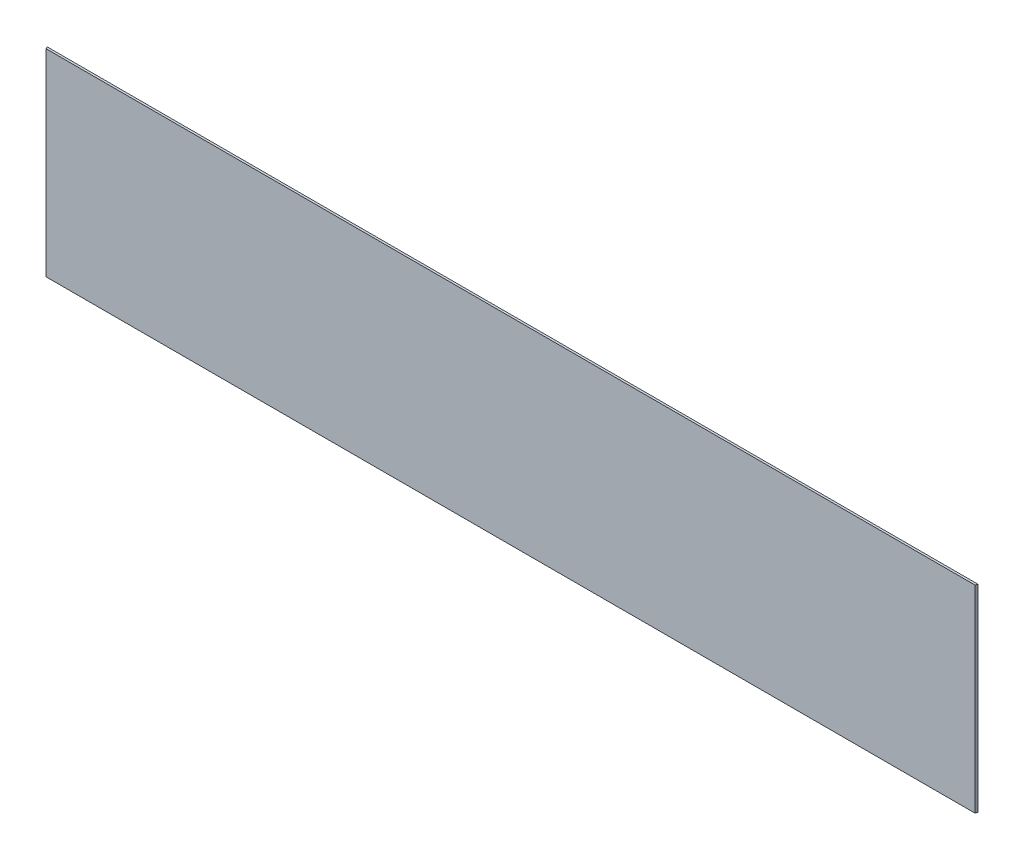
ISO-10303-21;
HEADER;
FILE_DESCRIPTION(('STEP AP214'),'2;1');
FILE_NAME('part.step','',(''),(''),'','','');
FILE_SCHEMA(('AUTOMOTIVE_DESIGN { 1 0 10303 214 1 1 1 1 }'));
ENDSEC;
DATA;
#1=APPLICATION_CONTEXT('core data for automotive mechanical design processes');
#2=APPLICATION_PROTOCOL_DEFINITION('international standard','automotive_design',2000,#1);
#3=PRODUCT_CONTEXT('',#1,'mechanical');
#4=PRODUCT('Part','Part','',(#3));
#5=PRODUCT_RELATED_PRODUCT_CATEGORY('part','',(#4));
#6=PRODUCT_DEFINITION_FORMATION('','',#4);
#7=PRODUCT_DEFINITION_CONTEXT('part definition',#1,'design');
#8=PRODUCT_DEFINITION('design','',#6,#7);
#9=PRODUCT_DEFINITION_SHAPE('','',#8);
#10=(LENGTH_UNIT() NAMED_UNIT(*) SI_UNIT(.MILLI.,.METRE.));
#11=(NAMED_UNIT(*) PLANE_ANGLE_UNIT() SI_UNIT($,.RADIAN.));
#12=(NAMED_UNIT(*) SI_UNIT($,.STERADIAN.) SOLID_ANGLE_UNIT());
#13=UNCERTAINTY_MEASURE_WITH_UNIT(LENGTH_MEASURE(1.E-05),#10,'distance_accuracy_value','');
#14=(GEOMETRIC_REPRESENTATION_CONTEXT(3) GLOBAL_UNCERTAINTY_ASSIGNED_CONTEXT((#13)) GLOBAL_UNIT_ASSIGNED_CONTEXT((#10,
#11,#12)) REPRESENTATION_CONTEXT('',''));
#15=CARTESIAN_POINT('',(0.,0.,0.));
#16=DIRECTION('',(0.,0.,1.));
#17=DIRECTION('',(1.,0.,0.));
#18=AXIS2_PLACEMENT_3D('',#15,#16,#17);
#19=CARTESIAN_POINT('',(-673.099999999998,142.875,-1.58750000000001));
#20=DIRECTION('',(0.923879532511753,0.,-0.382683432363964));
#21=DIRECTION('',(-0.382683432363964,0.,-0.923879532511753));
#22=AXIS2_PLACEMENT_3D('',#19,#20,#21);
#23=PLANE('',#22);
#24=DIRECTION('',(0.382683432363964,0.,0.923879532511753));
#25=VECTOR('',#24,1.);
#26=CARTESIAN_POINT('',(-673.099999999998,-142.875,-1.58750000000001));
#27=LINE('',#26,#25);
#28=CARTESIAN_POINT('',(-673.099999999998,-142.875,-1.58750000000001));
#29=VERTEX_POINT('',#28);
#30=CARTESIAN_POINT('',(-671.784871939468,-142.875,1.58749999999995));
#31=VERTEX_POINT('',#30);
#32=EDGE_CURVE('E95',#29,#31,#27,.T.);
#33=ORIENTED_EDGE('',*,*,#32,.T.);
#34=DIRECTION('',(0.,-1.,0.));
#35=VECTOR('',#34,1.);
#36=CARTESIAN_POINT('',(-671.784871939468,142.875,1.58749999999995));
#37=LINE('',#36,#35);
#38=CARTESIAN_POINT('',(-671.784871939468,142.875,1.58749999999995));
#39=VERTEX_POINT('',#38);
#40=EDGE_CURVE('E11',#39,#31,#37,.T.);
#41=ORIENTED_EDGE('',*,*,#40,.F.);
#42=DIRECTION('',(0.382683432363964,0.,0.923879532511753));
#43=VECTOR('',#42,1.);
#44=CARTESIAN_POINT('',(-673.099999999998,142.875,-1.58750000000001));
#45=LINE('',#44,#43);
#46=CARTESIAN_POINT('',(-673.099999999998,142.875,-1.58750000000001));
#47=VERTEX_POINT('',#46);
#48=EDGE_CURVE('E83',#47,#39,#45,.T.);
#49=ORIENTED_EDGE('',*,*,#48,.F.);
#50=DIRECTION('',(0.,-1.,0.));
#51=VECTOR('',#50,1.);
#52=CARTESIAN_POINT('',(-673.099999999998,142.875,-1.58750000000001));
#53=LINE('',#52,#51);
#54=EDGE_CURVE('E91',#47,#29,#53,.T.);
#55=ORIENTED_EDGE('',*,*,#54,.T.);
#56=EDGE_LOOP('',(#33,#41,#49,#55));
#57=FACE_BOUND('',#56,.T.);
#58=ADVANCED_FACE('F32',(#57),#23,.F.);
#59=CARTESIAN_POINT('',(-671.784871939468,142.875,1.58749999999995));
#60=DIRECTION('',(0.,0.,-1.));
#61=DIRECTION('',(-1.,0.,0.));
#62=AXIS2_PLACEMENT_3D('',#59,#60,#61);
#63=PLANE('',#62);
#64=DIRECTION('',(1.,0.,0.));
#65=VECTOR('',#64,1.);
#66=CARTESIAN_POINT('',(-671.784871939468,-142.875,1.58749999999995));
#67=LINE('',#66,#65);
#68=CARTESIAN_POINT('',(671.784871939468,-142.875,1.58749999999999));
#69=VERTEX_POINT('',#68);
#70=EDGE_CURVE('E87',#31,#69,#67,.T.);
#71=ORIENTED_EDGE('',*,*,#70,.T.);
#72=DIRECTION('',(0.,-1.,0.));
#73=VECTOR('',#72,1.);
#74=CARTESIAN_POINT('',(671.784871939468,142.875,1.58749999999999));
#75=LINE('',#74,#73);
#76=CARTESIAN_POINT('',(671.784871939468,142.875,1.58749999999999));
#77=VERTEX_POINT('',#76);
#78=EDGE_CURVE('E40',#77,#69,#75,.T.);
#79=ORIENTED_EDGE('',*,*,#78,.F.);
#80=DIRECTION('',(1.,0.,0.));
#81=VECTOR('',#80,1.);
#82=CARTESIAN_POINT('',(-671.784871939468,142.875,1.58749999999995));
#83=LINE('',#82,#81);
#84=EDGE_CURVE('E78',#39,#77,#83,.T.);
#85=ORIENTED_EDGE('',*,*,#84,.F.);
#86=ORIENTED_EDGE('',*,*,#40,.T.);
#87=EDGE_LOOP('',(#71,#79,#85,#86));
#88=FACE_BOUND('',#87,.T.);
#89=ADVANCED_FACE('F86',(#88),#63,.F.);
#90=CARTESIAN_POINT('',(673.100000000002,142.875,-1.58750000000001));
#91=DIRECTION('',(-0.923879532511287,0.,-0.38268343236509));
#92=DIRECTION('',(-0.38268343236509,0.,0.923879532511287));
#93=AXIS2_PLACEMENT_3D('',#90,#91,#92);
#94=PLANE('',#93);
#95=DIRECTION('',(0.38268343236509,0.,-0.923879532511287));
#96=VECTOR('',#95,1.);
#97=CARTESIAN_POINT('',(673.100000000002,-142.875,-1.58750000000001));
#98=LINE('',#97,#96);
#99=CARTESIAN_POINT('',(673.100000000002,-142.875,-1.58750000000001));
#100=VERTEX_POINT('',#99);
#101=EDGE_CURVE('E65',#69,#100,#98,.T.);
#102=ORIENTED_EDGE('',*,*,#101,.T.);
#103=DIRECTION('',(0.,-1.,0.));
#104=VECTOR('',#103,1.);
#105=CARTESIAN_POINT('',(673.100000000002,142.875,-1.58750000000001));
#106=LINE('',#105,#104);
#107=CARTESIAN_POINT('',(673.100000000002,142.875,-1.58750000000001));
#108=VERTEX_POINT('',#107);
#109=EDGE_CURVE('E88',#108,#100,#106,.T.);
#110=ORIENTED_EDGE('',*,*,#109,.F.);
#111=DIRECTION('',(0.38268343236509,0.,-0.923879532511287));
#112=VECTOR('',#111,1.);
#113=CARTESIAN_POINT('',(673.100000000002,142.875,-1.58750000000001));
#114=LINE('',#113,#112);
#115=EDGE_CURVE('E81',#77,#108,#114,.T.);
#116=ORIENTED_EDGE('',*,*,#115,.F.);
#117=ORIENTED_EDGE('',*,*,#78,.T.);
#118=EDGE_LOOP('',(#102,#110,#116,#117));
#119=FACE_BOUND('',#118,.T.);
#120=ADVANCED_FACE('F89',(#119),#94,.F.);
#121=CARTESIAN_POINT('',(-673.099999999998,142.875,-1.58750000000001));
#122=DIRECTION('',(0.,0.,1.));
#123=DIRECTION('',(1.,0.,0.));
#124=AXIS2_PLACEMENT_3D('',#121,#122,#123);
#125=PLANE('',#124);
#126=DIRECTION('',(-1.,0.,0.));
#127=VECTOR('',#126,1.);
#128=CARTESIAN_POINT('',(-673.099999999998,-142.875,-1.58750000000001));
#129=LINE('',#128,#127);
#130=EDGE_CURVE('E71',#100,#29,#129,.T.);
#131=ORIENTED_EDGE('',*,*,#130,.T.);
#132=ORIENTED_EDGE('',*,*,#54,.F.);
#133=DIRECTION('',(-1.,0.,0.));
#134=VECTOR('',#133,1.);
#135=CARTESIAN_POINT('',(-673.099999999998,142.875,-1.58750000000001));
#136=LINE('',#135,#134);
#137=EDGE_CURVE('E48',#108,#47,#136,.T.);
#138=ORIENTED_EDGE('',*,*,#137,.F.);
#139=ORIENTED_EDGE('',*,*,#109,.T.);
#140=EDGE_LOOP('',(#131,#132,#138,#139));
#141=FACE_BOUND('',#140,.T.);
#142=ADVANCED_FACE('F102',(#141),#125,.F.);
#143=CARTESIAN_POINT('',(-671.784871939468,142.875,1.58749999999995));
#144=DIRECTION('',(0.,1.,0.));
#145=DIRECTION('',(0.,0.,1.));
#146=AXIS2_PLACEMENT_3D('',#143,#144,#145);
#147=PLANE('',#146);
#148=ORIENTED_EDGE('',*,*,#48,.T.);
#149=ORIENTED_EDGE('',*,*,#84,.T.);
#150=ORIENTED_EDGE('',*,*,#115,.T.);
#151=ORIENTED_EDGE('',*,*,#137,.T.);
#152=EDGE_LOOP('',(#148,#149,#150,#151));
#153=FACE_BOUND('',#152,.T.);
#154=ADVANCED_FACE('F79',(#153),#147,.T.);
#155=CARTESIAN_POINT('',(-671.784871939468,-142.875,1.58749999999995));
#156=DIRECTION('',(0.,1.,0.));
#157=DIRECTION('',(0.,0.,1.));
#158=AXIS2_PLACEMENT_3D('',#155,#156,#157);
#159=PLANE('',#158);
#160=ORIENTED_EDGE('',*,*,#32,.F.);
#161=ORIENTED_EDGE('',*,*,#130,.F.);
#162=ORIENTED_EDGE('',*,*,#101,.F.);
#163=ORIENTED_EDGE('',*,*,#70,.F.);
#164=EDGE_LOOP('',(#160,#161,#162,#163));
#165=FACE_BOUND('',#164,.T.);
#166=ADVANCED_FACE('F105',(#165),#159,.F.);
#167=CLOSED_SHELL('',(#58,#89,#120,#142,#154,#166));
#168=MANIFOLD_SOLID_BREP('B2',#167);
#169=ADVANCED_BREP_SHAPE_REPRESENTATION('',(#18,#168),#14);
#170=SHAPE_DEFINITION_REPRESENTATION(#9,#169);
ENDSEC;
END-ISO-10303-21;
